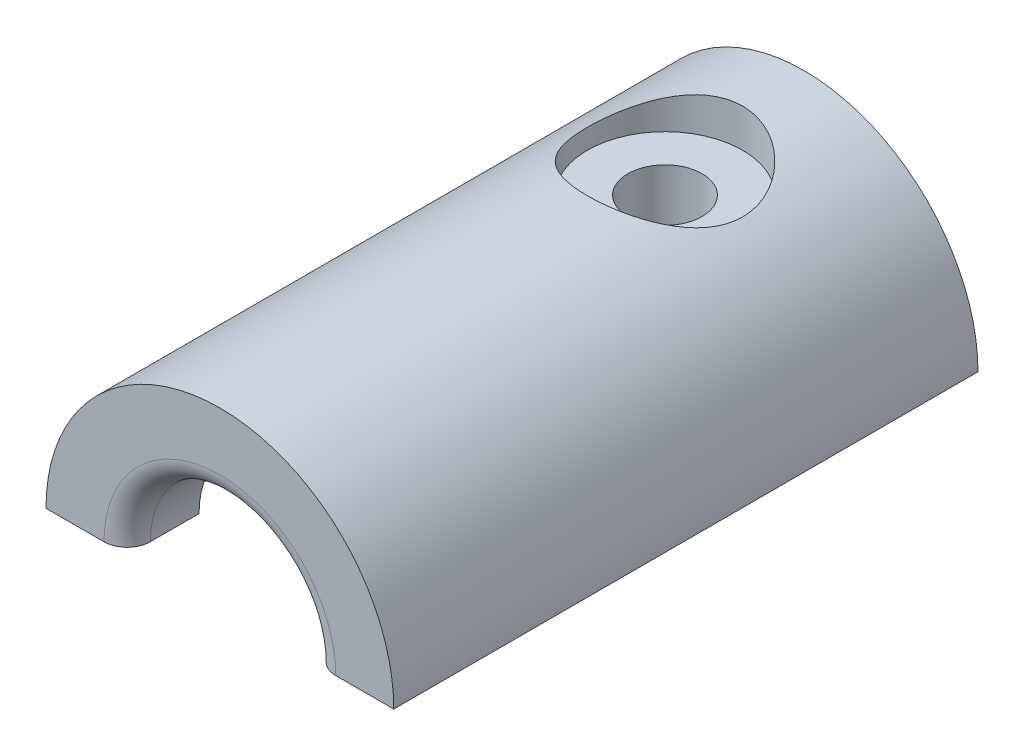
ISO-10303-21;
HEADER;
FILE_DESCRIPTION(('STEP AP214'),'2;1');
FILE_NAME('part.step','',(''),(''),'','','');
FILE_SCHEMA(('AUTOMOTIVE_DESIGN { 1 0 10303 214 1 1 1 1 }'));
ENDSEC;
DATA;
#1=APPLICATION_CONTEXT('core data for automotive mechanical design processes');
#2=APPLICATION_PROTOCOL_DEFINITION('international standard','automotive_design',2000,#1);
#3=PRODUCT_CONTEXT('',#1,'mechanical');
#4=PRODUCT('Part','Part','',(#3));
#5=PRODUCT_RELATED_PRODUCT_CATEGORY('part','',(#4));
#6=PRODUCT_DEFINITION_FORMATION('','',#4);
#7=PRODUCT_DEFINITION_CONTEXT('part definition',#1,'design');
#8=PRODUCT_DEFINITION('design','',#6,#7);
#9=PRODUCT_DEFINITION_SHAPE('','',#8);
#10=(LENGTH_UNIT() NAMED_UNIT(*) SI_UNIT(.MILLI.,.METRE.));
#11=(NAMED_UNIT(*) PLANE_ANGLE_UNIT() SI_UNIT($,.RADIAN.));
#12=(NAMED_UNIT(*) SI_UNIT($,.STERADIAN.) SOLID_ANGLE_UNIT());
#13=UNCERTAINTY_MEASURE_WITH_UNIT(LENGTH_MEASURE(1.E-05),#10,'distance_accuracy_value','');
#14=(GEOMETRIC_REPRESENTATION_CONTEXT(3) GLOBAL_UNCERTAINTY_ASSIGNED_CONTEXT((#13)) GLOBAL_UNIT_ASSIGNED_CONTEXT((#10,
#11,#12)) REPRESENTATION_CONTEXT('',''));
#15=CARTESIAN_POINT('',(0.,0.,0.));
#16=DIRECTION('',(0.,0.,1.));
#17=DIRECTION('',(1.,0.,0.));
#18=AXIS2_PLACEMENT_3D('',#15,#16,#17);
#19=CARTESIAN_POINT('',(0.,0.,10.5));
#20=DIRECTION('',(0.,0.,1.));
#21=DIRECTION('',(1.,0.,0.));
#22=AXIS2_PLACEMENT_3D('',#19,#20,#21);
#23=PLANE('',#22);
#24=DIRECTION('',(-1.,0.,0.));
#25=VECTOR('',#24,1.);
#26=CARTESIAN_POINT('',(0.,0.,10.5));
#27=LINE('',#26,#25);
#28=CARTESIAN_POINT('',(5.075,0.,10.5));
#29=VERTEX_POINT('',#28);
#30=CARTESIAN_POINT('',(4.,0.,10.5));
#31=VERTEX_POINT('',#30);
#32=EDGE_CURVE('E274',#29,#31,#27,.T.);
#33=ORIENTED_EDGE('',*,*,#32,.F.);
#34=CARTESIAN_POINT('',(0.,0.,10.5));
#35=DIRECTION('',(0.,0.,1.));
#36=DIRECTION('',(1.,0.,0.));
#37=AXIS2_PLACEMENT_3D('',#34,#35,#36);
#38=CIRCLE('',#37,5.075);
#39=CARTESIAN_POINT('',(-5.075,0.,10.5));
#40=VERTEX_POINT('',#39);
#41=EDGE_CURVE('E159',#29,#40,#38,.T.);
#42=ORIENTED_EDGE('',*,*,#41,.T.);
#43=CARTESIAN_POINT('',(-4.,0.,10.5));
#44=VERTEX_POINT('',#43);
#45=EDGE_CURVE('E271',#44,#40,#27,.T.);
#46=ORIENTED_EDGE('',*,*,#45,.F.);
#47=CARTESIAN_POINT('',(0.,0.,10.5));
#48=DIRECTION('',(0.,0.,1.));
#49=DIRECTION('',(1.,0.,0.));
#50=AXIS2_PLACEMENT_3D('',#47,#48,#49);
#51=CIRCLE('',#50,4.);
#52=EDGE_CURVE('E169',#31,#44,#51,.T.);
#53=ORIENTED_EDGE('',*,*,#52,.F.);
#54=EDGE_LOOP('',(#33,#42,#46,#53));
#55=FACE_BOUND('',#54,.T.);
#56=ADVANCED_FACE('F44',(#55),#23,.T.);
#57=CARTESIAN_POINT('',(0.,0.,7.5));
#58=DIRECTION('',(0.,0.,1.));
#59=DIRECTION('',(1.,0.,0.));
#60=AXIS2_PLACEMENT_3D('',#57,#58,#59);
#61=PLANE('',#60);
#62=DIRECTION('',(-1.,0.,0.));
#63=VECTOR('',#62,1.);
#64=CARTESIAN_POINT('',(0.,0.,7.5));
#65=LINE('',#64,#63);
#66=CARTESIAN_POINT('',(4.,0.,7.5));
#67=VERTEX_POINT('',#66);
#68=CARTESIAN_POINT('',(3.,0.,7.5));
#69=VERTEX_POINT('',#68);
#70=EDGE_CURVE('E279',#67,#69,#65,.T.);
#71=ORIENTED_EDGE('',*,*,#70,.F.);
#72=CARTESIAN_POINT('',(0.,0.,7.5));
#73=DIRECTION('',(0.,0.,1.));
#74=DIRECTION('',(1.,0.,0.));
#75=AXIS2_PLACEMENT_3D('',#72,#73,#74);
#76=CIRCLE('',#75,4.);
#77=CARTESIAN_POINT('',(-4.,0.,7.5));
#78=VERTEX_POINT('',#77);
#79=EDGE_CURVE('E168',#67,#78,#76,.T.);
#80=ORIENTED_EDGE('',*,*,#79,.T.);
#81=CARTESIAN_POINT('',(-3.,0.,7.5));
#82=VERTEX_POINT('',#81);
#83=EDGE_CURVE('E276',#82,#78,#65,.T.);
#84=ORIENTED_EDGE('',*,*,#83,.F.);
#85=CARTESIAN_POINT('',(0.,0.,7.5));
#86=DIRECTION('',(0.,0.,1.));
#87=DIRECTION('',(1.,0.,0.));
#88=AXIS2_PLACEMENT_3D('',#85,#86,#87);
#89=CIRCLE('',#88,3.);
#90=EDGE_CURVE('E174',#69,#82,#89,.T.);
#91=ORIENTED_EDGE('',*,*,#90,.F.);
#92=EDGE_LOOP('',(#71,#80,#84,#91));
#93=FACE_BOUND('',#92,.T.);
#94=ADVANCED_FACE('F224',(#93),#61,.T.);
#95=CARTESIAN_POINT('',(0.,0.,7.5));
#96=DIRECTION('',(0.,0.,-1.));
#97=DIRECTION('',(-1.,0.,0.));
#98=AXIS2_PLACEMENT_3D('',#95,#96,#97);
#99=CYLINDRICAL_SURFACE('',#98,3.);
#100=DIRECTION('',(0.,0.,-1.));
#101=VECTOR('',#100,1.);
#102=CARTESIAN_POINT('',(-3.,0.,7.5));
#103=LINE('',#102,#101);
#104=CARTESIAN_POINT('',(-3.,0.,-5.5));
#105=VERTEX_POINT('',#104);
#106=EDGE_CURVE('E278',#105,#82,#103,.F.);
#107=ORIENTED_EDGE('',*,*,#106,.F.);
#108=CARTESIAN_POINT('',(0.,0.,-5.5));
#109=DIRECTION('',(0.,0.,1.));
#110=DIRECTION('',(1.,0.,0.));
#111=AXIS2_PLACEMENT_3D('',#108,#109,#110);
#112=CIRCLE('',#111,3.);
#113=CARTESIAN_POINT('',(3.,0.,-5.5));
#114=VERTEX_POINT('',#113);
#115=EDGE_CURVE('E52',#105,#114,#112,.F.);
#116=ORIENTED_EDGE('',*,*,#115,.T.);
#117=DIRECTION('',(0.,0.,-1.));
#118=VECTOR('',#117,1.);
#119=CARTESIAN_POINT('',(3.,0.,7.5));
#120=LINE('',#119,#118);
#121=EDGE_CURVE('E285',#69,#114,#120,.T.);
#122=ORIENTED_EDGE('',*,*,#121,.F.);
#123=ORIENTED_EDGE('',*,*,#90,.T.);
#124=EDGE_LOOP('',(#107,#116,#122,#123));
#125=FACE_BOUND('',#124,.T.);
#126=CARTESIAN_POINT('',(0.,3.,0.0999999999999985));
#127=CARTESIAN_POINT('',(-0.0834280085828024,2.99999516830785,0.0999945834258236));
#128=CARTESIAN_POINT('',(-0.166934582506535,2.99648378720922,0.0934368071766237));
#129=CARTESIAN_POINT('',(-0.331436394670318,2.98278259335468,0.0675165982663954));
#130=CARTESIAN_POINT('',(-0.412427539682874,2.97258243738723,0.0481343339923473));
#131=CARTESIAN_POINT('',(-0.569277189891046,2.94656073601314,-0.00243967971600229));
#132=CARTESIAN_POINT('',(-0.645155024474135,2.93076195982554,-0.0335836283787828));
#133=CARTESIAN_POINT('',(-0.79047094845943,2.89495499745187,-0.106525103424968));
#134=CARTESIAN_POINT('',(-0.859909008635981,2.87494679216347,-0.148322678154541));
#135=CARTESIAN_POINT('',(-0.995534638915593,2.83095801330151,-0.24450312345995));
#136=CARTESIAN_POINT('',(-1.06120405491229,2.80680229614067,-0.299535207025925));
#137=CARTESIAN_POINT('',(-1.18286806133739,2.75774084341935,-0.419206291387087));
#138=CARTESIAN_POINT('',(-1.23885417984541,2.73283447325624,-0.483853613518118));
#139=CARTESIAN_POINT('',(-1.34470883896841,2.68244281334124,-0.627956116905107));
#140=CARTESIAN_POINT('',(-1.39355367383636,2.65711191284795,-0.708224097121125));
#141=CARTESIAN_POINT('',(-1.4768528324153,2.6117367722112,-0.877291362492924));
#142=CARTESIAN_POINT('',(-1.51131827632936,2.59168845125878,-0.966083989554308));
#143=CARTESIAN_POINT('',(-1.56248710339327,2.56114789725882,-1.14410853876906));
#144=CARTESIAN_POINT('',(-1.5801662348633,2.55013659138239,-1.2329659441932));
#145=CARTESIAN_POINT('',(-1.60018994479719,2.53762662306212,-1.41300774391914));
#146=CARTESIAN_POINT('',(-1.60255389391569,2.53611594428854,-1.50418905226538));
#147=CARTESIAN_POINT('',(-1.59259204330144,2.54237297611912,-1.67244373129593));
#148=CARTESIAN_POINT('',(-1.5822864459542,2.54886502713221,-1.74969689324516));
#149=CARTESIAN_POINT('',(-1.55082691014658,2.56812634563423,-1.9011492478833));
#150=CARTESIAN_POINT('',(-1.52966860751486,2.58089813829439,-1.97534719901126));
#151=CARTESIAN_POINT('',(-1.47678050478154,2.6115255571428,-2.12067605314732));
#152=CARTESIAN_POINT('',(-1.4448238898618,2.62948894800927,-2.19170060617008));
#153=CARTESIAN_POINT('',(-1.37143304593392,2.66850094165746,-2.32773905271474));
#154=CARTESIAN_POINT('',(-1.32999461708736,2.68955091010761,-2.39275026473803));
#155=CARTESIAN_POINT('',(-1.23173704487371,2.73609049880501,-2.52497172242656));
#156=CARTESIAN_POINT('',(-1.17355258231979,2.76177798986485,-2.59110147049342));
#157=CARTESIAN_POINT('',(-1.0469027467487,2.81223117246244,-2.71315071537989));
#158=CARTESIAN_POINT('',(-0.978431146098923,2.83699629420455,-2.76906398158625));
#159=CARTESIAN_POINT('',(-0.828044154062362,2.88460021999069,-2.87227542982841));
#160=CARTESIAN_POINT('',(-0.745570968821582,2.90723646176344,-2.91886221638782));
#161=CARTESIAN_POINT('',(-0.572453719472288,2.9462079060851,-2.9970957663538));
#162=CARTESIAN_POINT('',(-0.481817034499115,2.96254873003402,-3.02875586400623));
#163=CARTESIAN_POINT('',(-0.30366442791181,2.9858199122846,-3.07335522481456));
#164=CARTESIAN_POINT('',(-0.216600262764062,2.99346409984953,-3.08772140261997));
#165=CARTESIAN_POINT('',(-0.0409791950824067,3.00100442054404,-3.10189500640086));
#166=CARTESIAN_POINT('',(0.0475768145688012,3.00090503432182,-3.10171085160458));
#167=CARTESIAN_POINT('',(0.215091919521215,2.99334764517664,-3.08750014233865));
#168=CARTESIAN_POINT('',(0.294192898535464,2.98655794488573,-3.07473071850347));
#169=CARTESIAN_POINT('',(0.448939109663164,2.96724376655693,-3.03778511580416));
#170=CARTESIAN_POINT('',(0.524583981374493,2.95471869192973,-3.0136077502866));
#171=CARTESIAN_POINT('',(0.672500335044404,2.92465141623378,-2.95405011506354));
#172=CARTESIAN_POINT('',(0.744640666753738,2.9069918992478,-2.91840553016343));
#173=CARTESIAN_POINT('',(0.882124314821923,2.86826876163522,-2.83724969139679));
#174=CARTESIAN_POINT('',(0.947464964005449,2.84720381343929,-2.7917345872462));
#175=CARTESIAN_POINT('',(1.07697928921282,2.80095291390707,-2.68651039778454));
#176=CARTESIAN_POINT('',(1.1402697302165,2.77556745933858,-2.62580066534228));
#177=CARTESIAN_POINT('',(1.256219725483,2.72505417098626,-2.49477432816968));
#178=CARTESIAN_POINT('',(1.30886943094942,2.69992659611925,-2.42444892341591));
#179=CARTESIAN_POINT('',(1.40548153261782,2.65099028655931,-2.27034702764994));
#180=CARTESIAN_POINT('',(1.44862048937835,2.62738421458254,-2.18598372244117));
#181=CARTESIAN_POINT('',(1.51964969635314,2.58695870125936,-2.00957981982766));
#182=CARTESIAN_POINT('',(1.54756166073896,2.57012960475316,-1.9175503717565));
#183=CARTESIAN_POINT('',(1.5845909036139,2.54745026922036,-1.73797230580491));
#184=CARTESIAN_POINT('',(1.59528122309048,2.54068617365327,-1.65086763256909));
#185=CARTESIAN_POINT('',(1.60220766902338,2.53632719775287,-1.47587937163927));
#186=CARTESIAN_POINT('',(1.59845364948011,2.53872606639137,-1.38799635575484));
#187=CARTESIAN_POINT('',(1.57811270148832,2.55140495355656,-1.22530729028392));
#188=CARTESIAN_POINT('',(1.56314118274069,2.5606915110498,-1.15021021854508));
#189=CARTESIAN_POINT('',(1.52298687295876,2.58477383442181,-1.00373208491777));
#190=CARTESIAN_POINT('',(1.49780029499239,2.59957164326813,-0.93235241223123));
#191=CARTESIAN_POINT('',(1.43616070422438,2.63415331148715,-0.790190440907262));
#192=CARTESIAN_POINT('',(1.3990864148575,2.65419696823125,-0.719742865169907));
#193=CARTESIAN_POINT('',(1.31534245335433,2.6966792141344,-0.585596128479051));
#194=CARTESIAN_POINT('',(1.26866761463333,2.71911908969113,-0.521900629275876));
#195=CARTESIAN_POINT('',(1.15916720525938,2.76774539611286,-0.393453812245603));
#196=CARTESIAN_POINT('',(1.09498203667427,2.79400424140764,-0.329882519126992));
#197=CARTESIAN_POINT('',(0.956300329149745,2.8444566012759,-0.214055459199152));
#198=CARTESIAN_POINT('',(0.881797165766555,2.86864877272258,-0.161807017699894));
#199=CARTESIAN_POINT('',(0.72204400515354,2.91302030182076,-0.069132080235816));
#200=CARTESIAN_POINT('',(0.636577331123638,2.93308821046928,-0.0290227475325287));
#201=CARTESIAN_POINT('',(0.458798662878496,2.96607713011319,0.0357072451099689));
#202=CARTESIAN_POINT('',(0.36650569376879,2.97901721406285,0.0603692641835009));
#203=CARTESIAN_POINT('',(0.227615355842192,2.99169552229494,0.0843853425759249));
#204=CARTESIAN_POINT('',(0.182355494246517,2.9947988863485,0.0902297684119494));
#205=CARTESIAN_POINT('',(0.091404954885603,2.9989524612278,0.0980386043083724));
#206=CARTESIAN_POINT('',(0.0457142719789322,3.00000264751962,0.10000296800498));
#207=CARTESIAN_POINT('',(0.,3.,0.0999999999999985));
#208=B_SPLINE_CURVE_WITH_KNOTS('',3,(#126,#127,#128,#129,#130,#131,#132,#133,#134,#135,#136,
#137,#138,#139,#140,#141,#142,#143,#144,#145,#146,#147,#148,#149,#150,#151,#152,#153,#154,#155,
#156,#157,#158,#159,#160,#161,#162,#163,#164,#165,#166,#167,#168,#169,#170,#171,#172,#173,#174,
#175,#176,#177,#178,#179,#180,#181,#182,#183,#184,#185,#186,#187,#188,#189,#190,#191,#192,#193,
#194,#195,#196,#197,#198,#199,#200,#201,#202,#203,#204,#205,#206,#207),.UNSPECIFIED.,.T.,.F.,(4,
2,2,2,2,2,2,2,2,2,2,2,2,2,2,2,2,2,2,2,2,2,2,2,2,2,2,2,2,2,2,2,2,2,2,2,2,2,2,2,4),(0.,
0.250099571937983,0.500586801159414,0.750066790862756,0.999547912726739,1.26551787503545,
1.53171937023862,1.82220042181315,2.11245641359362,2.38456600858369,2.65633137184324,
2.88985639109233,3.12347539088301,3.36234274397109,3.60131610556614,3.87540340557936,
4.14965730631695,4.44024459698543,4.7305718072894,4.99480330643343,5.2588819149833,
5.49900649956852,5.73915606740714,5.98529384057671,6.23152780022619,6.50427545175261,
6.77727440700571,7.06865169074468,7.35961236784539,7.62207574902765,7.8843601081339,
8.11476177641519,8.34524893751088,8.59058452776184,8.83605249367795,9.11702751803744,
9.3981837798729,9.68615329689656,9.97334846176489,10.110388568954,10.2474303136582),.UNSPECIFIED.);
#209=CARTESIAN_POINT('',(0.,3.,0.0999999999999985));
#210=VERTEX_POINT('',#209);
#211=EDGE_CURVE('E162',#210,#210,#208,.T.);
#212=ORIENTED_EDGE('',*,*,#211,.F.);
#213=EDGE_LOOP('',(#212));
#214=FACE_BOUND('',#213,.T.);
#215=ADVANCED_FACE('F193',(#125,#214),#99,.F.);
#216=CARTESIAN_POINT('',(0.,0.,7.5));
#217=DIRECTION('',(0.,0.,-1.));
#218=DIRECTION('',(-1.,0.,0.));
#219=AXIS2_PLACEMENT_3D('',#216,#217,#218);
#220=CYLINDRICAL_SURFACE('',#219,7.5);
#221=CARTESIAN_POINT('',(0.,7.5,1.85));
#222=CARTESIAN_POINT('',(-0.0891878230733522,7.49999912717261,1.84999885503585));
#223=CARTESIAN_POINT('',(-0.178401619690432,7.49840328474661,1.84643118553665));
#224=CARTESIAN_POINT('',(-0.356163969702491,7.49206834436336,1.83220936869034));
#225=CARTESIAN_POINT('',(-0.444712117774008,7.48732746695073,1.82155120954673));
#226=CARTESIAN_POINT('',(-0.708674647806668,7.46851951941904,1.77902334732359));
#227=CARTESIAN_POINT('',(-0.882198739312517,7.44986751761951,1.73660055745727));
#228=CARTESIAN_POINT('',(-1.21830845258325,7.40233329988101,1.625621491257));
#229=CARTESIAN_POINT('',(-1.380930826572,7.37348775104977,1.55715881624625));
#230=CARTESIAN_POINT('',(-1.69223885151417,7.30832508429754,1.39646429333172));
#231=CARTESIAN_POINT('',(-1.84092758523209,7.27200962477349,1.30423772011118));
#232=CARTESIAN_POINT('',(-2.12868009271889,7.1931994009275,1.09319633940562));
#233=CARTESIAN_POINT('',(-2.26686162597413,7.15048348827961,0.97326221261356));
#234=CARTESIAN_POINT('',(-2.52192139812771,7.06456337005768,0.712626946106595));
#235=CARTESIAN_POINT('',(-2.63878681123637,7.02135888700638,0.571913395058772));
#236=CARTESIAN_POINT('',(-2.85473473918864,6.93648005152526,0.263621161077236));
#237=CARTESIAN_POINT('',(-2.95237827929314,6.89504280297632,0.0949528442853051));
#238=CARTESIAN_POINT('',(-3.07618717042241,6.84025629481261,-0.169920319053192));
#239=CARTESIAN_POINT('',(-3.11369038550638,6.82321742608652,-0.260225345375181));
#240=CARTESIAN_POINT('',(-3.1807853811548,6.79219938073378,-0.444219200727892));
#241=CARTESIAN_POINT('',(-3.21038142251154,6.77821855701441,-0.537906176369654));
#242=CARTESIAN_POINT('',(-3.25997092181759,6.754502626582,-0.722965669301146));
#243=CARTESIAN_POINT('',(-3.2803867469492,6.74458323749404,-0.814201695923129));
#244=CARTESIAN_POINT('',(-3.31354455557216,6.72835519410406,-0.998334628482308));
#245=CARTESIAN_POINT('',(-3.32629024871183,6.72204479439295,-1.09123070911471));
#246=CARTESIAN_POINT('',(-3.34394429802972,6.71328069807371,-1.27791978737817));
#247=CARTESIAN_POINT('',(-3.34885545443921,6.71082562349468,-1.37171245248719));
#248=CARTESIAN_POINT('',(-3.3507900876502,6.70985802583827,-1.55937014430342));
#249=CARTESIAN_POINT('',(-3.34781407932856,6.71134524540655,-1.65323516588729));
#250=CARTESIAN_POINT('',(-3.32833216588142,6.72104790031709,-1.9167427983518));
#251=CARTESIAN_POINT('',(-3.30275991249415,6.73376702753982,-2.08565189705706));
#252=CARTESIAN_POINT('',(-3.22670839757228,6.77053019821457,-2.4163612924311));
#253=CARTESIAN_POINT('',(-3.17622346470564,6.79457682029626,-2.57815996128367));
#254=CARTESIAN_POINT('',(-3.0507911103768,6.85182530028182,-2.89455181996008));
#255=CARTESIAN_POINT('',(-2.97531834980044,6.88522115605906,-3.04890065522463));
#256=CARTESIAN_POINT('',(-2.80242821411735,6.95738136763024,-3.34339129462046));
#257=CARTESIAN_POINT('',(-2.70500155934726,6.99614799091019,-3.4835270546171));
#258=CARTESIAN_POINT('',(-2.47973061889216,7.07931556142899,-3.76015415294416));
#259=CARTESIAN_POINT('',(-2.34983548709551,7.12389537195385,-3.89492697480307));
#260=CARTESIAN_POINT('',(-2.06891983186436,7.21048991066163,-4.14140119525038));
#261=CARTESIAN_POINT('',(-1.91789281917564,7.25250384519153,-4.25309548060483));
#262=CARTESIAN_POINT('',(-1.59310980978697,7.33080450784286,-4.45329487297038));
#263=CARTESIAN_POINT('',(-1.41880637415762,7.36688070419938,-4.54100050768136));
#264=CARTESIAN_POINT('',(-1.05589356321835,7.42757299791375,-4.68522309058996));
#265=CARTESIAN_POINT('',(-0.867293385301565,7.45219639154444,-4.74175989987477));
#266=CARTESIAN_POINT('',(-0.49541423458716,7.48578242804196,-4.81821104641536));
#267=CARTESIAN_POINT('',(-0.312697029728641,7.49572649594334,-4.84042562305749));
#268=CARTESIAN_POINT('',(0.0541143470097829,7.50204450595434,-4.85458259324785));
#269=CARTESIAN_POINT('',(0.238208023107876,7.49842311937112,-4.84653540752596));
#270=CARTESIAN_POINT('',(0.591106014494795,7.47863753129107,-4.80194940423143));
#271=CARTESIAN_POINT('',(0.760172761145971,7.46322355191668,-4.76711413466462));
#272=CARTESIAN_POINT('',(1.0898243614586,7.4222563077697,-4.67241307232124));
#273=CARTESIAN_POINT('',(1.25040818530438,7.39670181514277,-4.61254424833351));
#274=CARTESIAN_POINT('',(1.56422442090259,7.33686084189393,-4.46757681729823));
#275=CARTESIAN_POINT('',(1.71707166904953,7.30232701239935,-4.38174996232009));
#276=CARTESIAN_POINT('',(2.00674530156826,7.22809580323688,-4.18809628282505));
#277=CARTESIAN_POINT('',(2.14356465415082,7.1883961732213,-4.08025985869943));
#278=CARTESIAN_POINT('',(2.40903237079457,7.10404865147833,-3.83543526611232));
#279=CARTESIAN_POINT('',(2.5361114004775,7.05926090299216,-3.69678955909175));
#280=CARTESIAN_POINT('',(2.76573382727972,6.97250439020488,-3.399603633645));
#281=CARTESIAN_POINT('',(2.86826824448104,6.93053666166618,-3.24105616618016));
#282=CARTESIAN_POINT('',(3.048029107461,6.85341897165205,-2.90337469374242));
#283=CARTESIAN_POINT('',(3.124579475911,6.81845962370621,-2.72383382360263));
#284=CARTESIAN_POINT('',(3.24562568107346,6.76169082075318,-2.35233727249944));
#285=CARTESIAN_POINT('',(3.2901532977653,6.73986833199577,-2.16039410661238));
#286=CARTESIAN_POINT('',(3.34252277373077,6.71403874152609,-1.78717523166282));
#287=CARTESIAN_POINT('',(3.35317104785246,6.70867023355183,-1.60638702455598));
#288=CARTESIAN_POINT('',(3.34519481029594,6.71265216132077,-1.2456439261344));
#289=CARTESIAN_POINT('',(3.32657671161061,6.72199937248323,-1.06568886092309));
#290=CARTESIAN_POINT('',(3.26306098324107,6.75304004205783,-0.723199635893735));
#291=CARTESIAN_POINT('',(3.21984593482924,6.77394075563669,-0.560274064363178));
#292=CARTESIAN_POINT('',(3.11014911101142,6.82499900866567,-0.244011307139416));
#293=CARTESIAN_POINT('',(3.04366059198444,6.85515923079959,-0.0906769157403797));
#294=CARTESIAN_POINT('',(2.88441559448279,6.92373545957332,0.212860142203525));
#295=CARTESIAN_POINT('',(2.79024425832931,6.9625577948647,0.362226545176833));
#296=CARTESIAN_POINT('',(2.58012530772816,7.0431242917042,0.643910089808051));
#297=CARTESIAN_POINT('',(2.46416848263865,7.08486968438562,0.77621998013646));
#298=CARTESIAN_POINT('',(2.20164486607259,7.17101760321031,1.03215079861116));
#299=CARTESIAN_POINT('',(2.05327510819071,7.21532729460276,1.15395948267729));
#300=CARTESIAN_POINT('',(1.73654893060159,7.29801944853298,1.37118609811088));
#301=CARTESIAN_POINT('',(1.5681834083235,7.33639919317735,1.46659194392762));
#302=CARTESIAN_POINT('',(1.30505969454321,7.3861183968435,1.58683223249832));
#303=CARTESIAN_POINT('',(1.2160447547938,7.40132813537017,1.62298036196889));
#304=CARTESIAN_POINT('',(1.03484998023478,7.4288260416877,1.68760383509938));
#305=CARTESIAN_POINT('',(0.942671694899493,7.44111561710601,1.71608287643178));
#306=CARTESIAN_POINT('',(0.756075653319984,7.46238254483676,1.76498628481375));
#307=CARTESIAN_POINT('',(0.661663811011738,7.47136778571371,1.78542984342252));
#308=CARTESIAN_POINT('',(0.47120758644284,7.48579111608255,1.81809969845236));
#309=CARTESIAN_POINT('',(0.375164380395096,7.49123165847608,1.83033167739617));
#310=CARTESIAN_POINT('',(0.232402473803539,7.49654215287543,1.84225278484167));
#311=CARTESIAN_POINT('',(0.185981765942085,7.49783772853209,1.84515674831));
#312=CARTESIAN_POINT('',(0.0930430621754559,7.49956688511099,1.84903066655245));
#313=CARTESIAN_POINT('',(0.0465250650675257,7.50000045531273,1.8500005972736));
#314=CARTESIAN_POINT('',(0.,7.5,1.85));
#315=B_SPLINE_CURVE_WITH_KNOTS('',3,(#221,#222,#223,#224,#225,#226,#227,#228,#229,#230,#231,
#232,#233,#234,#235,#236,#237,#238,#239,#240,#241,#242,#243,#244,#245,#246,#247,#248,#249,#250,
#251,#252,#253,#254,#255,#256,#257,#258,#259,#260,#261,#262,#263,#264,#265,#266,#267,#268,#269,
#270,#271,#272,#273,#274,#275,#276,#277,#278,#279,#280,#281,#282,#283,#284,#285,#286,#287,#288,
#289,#290,#291,#292,#293,#294,#295,#296,#297,#298,#299,#300,#301,#302,#303,#304,#305,#306,#307,
#308,#309,#310,#311,#312,#313,#314),.UNSPECIFIED.,.T.,.F.,(4,2,2,2,2,2,2,2,2,2,2,2,2,2,2,2,2,2,
2,2,2,2,2,2,2,2,2,2,2,2,2,2,2,2,2,2,2,2,2,2,2,2,2,2,2,2,4),(0.,0.26751326393724,
0.53517801565926,1.07112426641232,1.6051619714855,2.13908124241904,2.70032995980735,
3.26191527134274,3.85633069213821,4.15375803401191,4.45102478199005,4.7326939199538,
5.01422671932786,5.29565887028437,5.57707264970395,6.08836497340047,6.59977374571786,
7.12270053434698,7.64584877423331,8.22052558835916,8.79537926520863,9.3875414547839,
9.97932587527004,10.5294027709321,11.0792902632907,11.5968365744592,12.1144455713584,
12.6481884955896,13.1821647144662,13.7595654782797,14.3371771687828,14.928835273785,
15.5199053928604,16.060534742559,16.601045643384,17.1083913405832,17.615884165951,
18.1560295211853,18.6964037593716,19.2847185999813,19.8733022901975,20.1647883673263,
20.4561336509594,20.7467788088226,21.0372226284548,21.1767698984418,21.3163189039251),.UNSPECIFIED.);
#316=CARTESIAN_POINT('',(0.,7.5,1.85));
#317=VERTEX_POINT('',#316);
#318=EDGE_CURVE('E177',#317,#317,#315,.T.);
#319=ORIENTED_EDGE('',*,*,#318,.T.);
#320=EDGE_LOOP('',(#319));
#321=FACE_BOUND('',#320,.T.);
#322=CARTESIAN_POINT('',(0.,0.,17.7));
#323=DIRECTION('',(0.,0.,1.));
#324=DIRECTION('',(1.,0.,0.));
#325=AXIS2_PLACEMENT_3D('',#322,#323,#324);
#326=CIRCLE('',#325,7.5);
#327=CARTESIAN_POINT('',(7.5,0.,17.7));
#328=VERTEX_POINT('',#327);
#329=CARTESIAN_POINT('',(-7.5,0.,17.7));
#330=VERTEX_POINT('',#329);
#331=EDGE_CURVE('E148',#328,#330,#326,.T.);
#332=ORIENTED_EDGE('',*,*,#331,.F.);
#333=DIRECTION('',(0.,0.,-1.));
#334=VECTOR('',#333,1.);
#335=CARTESIAN_POINT('',(7.5,0.,-7.5));
#336=LINE('',#335,#334);
#337=CARTESIAN_POINT('',(7.5,0.,-7.5));
#338=VERTEX_POINT('',#337);
#339=EDGE_CURVE('E141',#328,#338,#336,.T.);
#340=ORIENTED_EDGE('',*,*,#339,.T.);
#341=CARTESIAN_POINT('',(0.,0.,-7.5));
#342=DIRECTION('',(0.,0.,1.));
#343=DIRECTION('',(1.,0.,0.));
#344=AXIS2_PLACEMENT_3D('',#341,#342,#343);
#345=CIRCLE('',#344,7.5);
#346=CARTESIAN_POINT('',(-7.5,0.,-7.5));
#347=VERTEX_POINT('',#346);
#348=EDGE_CURVE('E150',#338,#347,#345,.T.);
#349=ORIENTED_EDGE('',*,*,#348,.T.);
#350=DIRECTION('',(0.,0.,1.));
#351=VECTOR('',#350,1.);
#352=CARTESIAN_POINT('',(-7.5,0.,-7.5));
#353=LINE('',#352,#351);
#354=EDGE_CURVE('E134',#347,#330,#353,.T.);
#355=ORIENTED_EDGE('',*,*,#354,.T.);
#356=EDGE_LOOP('',(#332,#340,#349,#355));
#357=FACE_BOUND('',#356,.T.);
#358=ADVANCED_FACE('F146',(#321,#357),#220,.T.);
#359=CARTESIAN_POINT('',(0.,0.,-7.5));
#360=DIRECTION('',(0.,0.,1.));
#361=DIRECTION('',(1.,0.,0.));
#362=AXIS2_PLACEMENT_3D('',#359,#360,#361);
#363=PLANE('',#362);
#364=DIRECTION('',(-1.,0.,0.));
#365=VECTOR('',#364,1.);
#366=CARTESIAN_POINT('',(-7.5,0.,-7.5));
#367=LINE('',#366,#365);
#368=CARTESIAN_POINT('',(5.,0.,-7.5));
#369=VERTEX_POINT('',#368);
#370=EDGE_CURVE('E259',#338,#369,#367,.T.);
#371=ORIENTED_EDGE('',*,*,#370,.T.);
#372=CARTESIAN_POINT('',(0.,0.,-7.5));
#373=DIRECTION('',(0.,0.,1.));
#374=DIRECTION('',(1.,0.,0.));
#375=AXIS2_PLACEMENT_3D('',#372,#373,#374);
#376=CIRCLE('',#375,5.);
#377=CARTESIAN_POINT('',(-5.,0.,-7.5));
#378=VERTEX_POINT('',#377);
#379=EDGE_CURVE('E253',#369,#378,#376,.T.);
#380=ORIENTED_EDGE('',*,*,#379,.T.);
#381=EDGE_CURVE('E258',#378,#347,#367,.T.);
#382=ORIENTED_EDGE('',*,*,#381,.T.);
#383=ORIENTED_EDGE('',*,*,#348,.F.);
#384=EDGE_LOOP('',(#371,#380,#382,#383));
#385=FACE_BOUND('',#384,.T.);
#386=ADVANCED_FACE('F220',(#385),#363,.F.);
#387=CARTESIAN_POINT('',(0.,0.,10.5));
#388=DIRECTION('',(0.,0.,-1.));
#389=DIRECTION('',(-1.,0.,0.));
#390=AXIS2_PLACEMENT_3D('',#387,#388,#389);
#391=CYLINDRICAL_SURFACE('',#390,4.);
#392=DIRECTION('',(0.,0.,-1.));
#393=VECTOR('',#392,1.);
#394=CARTESIAN_POINT('',(4.,0.,10.5));
#395=LINE('',#394,#393);
#396=EDGE_CURVE('E283',#31,#67,#395,.T.);
#397=ORIENTED_EDGE('',*,*,#396,.F.);
#398=ORIENTED_EDGE('',*,*,#52,.T.);
#399=DIRECTION('',(0.,0.,-1.));
#400=VECTOR('',#399,1.);
#401=CARTESIAN_POINT('',(-4.,0.,10.5));
#402=LINE('',#401,#400);
#403=EDGE_CURVE('E273',#78,#44,#402,.F.);
#404=ORIENTED_EDGE('',*,*,#403,.F.);
#405=ORIENTED_EDGE('',*,*,#79,.F.);
#406=EDGE_LOOP('',(#397,#398,#404,#405));
#407=FACE_BOUND('',#406,.T.);
#408=ADVANCED_FACE('F216',(#407),#391,.F.);
#409=CARTESIAN_POINT('',(0.,0.,14.6));
#410=DIRECTION('',(0.,0.,-1.));
#411=DIRECTION('',(-1.,0.,0.));
#412=AXIS2_PLACEMENT_3D('',#409,#410,#411);
#413=CYLINDRICAL_SURFACE('',#412,5.075);
#414=DIRECTION('',(0.,0.,-1.));
#415=VECTOR('',#414,1.);
#416=CARTESIAN_POINT('',(5.075,0.,14.6));
#417=LINE('',#416,#415);
#418=CARTESIAN_POINT('',(5.075,0.,14.6));
#419=VERTEX_POINT('',#418);
#420=EDGE_CURVE('E281',#419,#29,#417,.T.);
#421=ORIENTED_EDGE('',*,*,#420,.F.);
#422=CARTESIAN_POINT('',(0.,0.,14.6));
#423=DIRECTION('',(0.,0.,1.));
#424=DIRECTION('',(1.,0.,0.));
#425=AXIS2_PLACEMENT_3D('',#422,#423,#424);
#426=CIRCLE('',#425,5.075);
#427=CARTESIAN_POINT('',(-5.075,0.,14.6));
#428=VERTEX_POINT('',#427);
#429=EDGE_CURVE('E155',#419,#428,#426,.T.);
#430=ORIENTED_EDGE('',*,*,#429,.T.);
#431=DIRECTION('',(0.,0.,-1.));
#432=VECTOR('',#431,1.);
#433=CARTESIAN_POINT('',(-5.075,0.,14.6));
#434=LINE('',#433,#432);
#435=EDGE_CURVE('E268',#40,#428,#434,.F.);
#436=ORIENTED_EDGE('',*,*,#435,.F.);
#437=ORIENTED_EDGE('',*,*,#41,.F.);
#438=EDGE_LOOP('',(#421,#430,#436,#437));
#439=FACE_BOUND('',#438,.T.);
#440=ADVANCED_FACE('F212',(#439),#413,.F.);
#441=CARTESIAN_POINT('',(0.,0.,14.6));
#442=DIRECTION('',(0.,0.,1.));
#443=DIRECTION('',(1.,0.,0.));
#444=AXIS2_PLACEMENT_3D('',#441,#442,#443);
#445=PLANE('',#444);
#446=ORIENTED_EDGE('',*,*,#429,.F.);
#447=DIRECTION('',(-1.,0.,0.));
#448=VECTOR('',#447,1.);
#449=CARTESIAN_POINT('',(0.,0.,14.6));
#450=LINE('',#449,#448);
#451=CARTESIAN_POINT('',(4.,0.,14.6));
#452=VERTEX_POINT('',#451);
#453=EDGE_CURVE('E269',#419,#452,#450,.T.);
#454=ORIENTED_EDGE('',*,*,#453,.T.);
#455=CARTESIAN_POINT('',(0.,0.,14.6));
#456=DIRECTION('',(0.,0.,1.));
#457=DIRECTION('',(1.,0.,0.));
#458=AXIS2_PLACEMENT_3D('',#455,#456,#457);
#459=CIRCLE('',#458,4.);
#460=CARTESIAN_POINT('',(-4.,0.,14.6));
#461=VERTEX_POINT('',#460);
#462=EDGE_CURVE('E156',#452,#461,#459,.T.);
#463=ORIENTED_EDGE('',*,*,#462,.T.);
#464=EDGE_CURVE('E263',#461,#428,#450,.T.);
#465=ORIENTED_EDGE('',*,*,#464,.T.);
#466=EDGE_LOOP('',(#446,#454,#463,#465));
#467=FACE_BOUND('',#466,.T.);
#468=ADVANCED_FACE('F209',(#467),#445,.F.);
#469=CARTESIAN_POINT('',(0.,0.,17.7));
#470=DIRECTION('',(0.,0.,1.));
#471=DIRECTION('',(1.,0.,0.));
#472=AXIS2_PLACEMENT_3D('',#469,#470,#471);
#473=PLANE('',#472);
#474=DIRECTION('',(1.,0.,0.));
#475=VECTOR('',#474,1.);
#476=CARTESIAN_POINT('',(-7.5,0.,17.7));
#477=LINE('',#476,#475);
#478=CARTESIAN_POINT('',(-5.,0.,17.7));
#479=VERTEX_POINT('',#478);
#480=EDGE_CURVE('E131',#330,#479,#477,.T.);
#481=ORIENTED_EDGE('',*,*,#480,.T.);
#482=CARTESIAN_POINT('',(0.,0.,17.7));
#483=DIRECTION('',(0.,0.,1.));
#484=DIRECTION('',(1.,0.,0.));
#485=AXIS2_PLACEMENT_3D('',#482,#483,#484);
#486=CIRCLE('',#485,5.);
#487=CARTESIAN_POINT('',(5.,0.,17.7));
#488=VERTEX_POINT('',#487);
#489=EDGE_CURVE('E249',#479,#488,#486,.F.);
#490=ORIENTED_EDGE('',*,*,#489,.T.);
#491=EDGE_CURVE('E142',#488,#328,#477,.T.);
#492=ORIENTED_EDGE('',*,*,#491,.T.);
#493=ORIENTED_EDGE('',*,*,#331,.T.);
#494=EDGE_LOOP('',(#481,#490,#492,#493));
#495=FACE_BOUND('',#494,.T.);
#496=ADVANCED_FACE('F152',(#495),#473,.T.);
#497=CARTESIAN_POINT('',(0.,0.,17.7));
#498=DIRECTION('',(0.,0.,-1.));
#499=DIRECTION('',(-1.,0.,0.));
#500=AXIS2_PLACEMENT_3D('',#497,#498,#499);
#501=CYLINDRICAL_SURFACE('',#500,4.);
#502=DIRECTION('',(0.,0.,-1.));
#503=VECTOR('',#502,1.);
#504=CARTESIAN_POINT('',(4.,0.,17.7));
#505=LINE('',#504,#503);
#506=CARTESIAN_POINT('',(4.,0.,16.7));
#507=VERTEX_POINT('',#506);
#508=EDGE_CURVE('E241',#507,#452,#505,.T.);
#509=ORIENTED_EDGE('',*,*,#508,.F.);
#510=CARTESIAN_POINT('',(0.,0.,16.7));
#511=DIRECTION('',(0.,0.,1.));
#512=DIRECTION('',(1.,0.,0.));
#513=AXIS2_PLACEMENT_3D('',#510,#511,#512);
#514=CIRCLE('',#513,4.);
#515=CARTESIAN_POINT('',(-4.,0.,16.7));
#516=VERTEX_POINT('',#515);
#517=EDGE_CURVE('E243',#507,#516,#514,.T.);
#518=ORIENTED_EDGE('',*,*,#517,.T.);
#519=DIRECTION('',(0.,0.,-1.));
#520=VECTOR('',#519,1.);
#521=CARTESIAN_POINT('',(-4.,0.,17.7));
#522=LINE('',#521,#520);
#523=EDGE_CURVE('E240',#461,#516,#522,.F.);
#524=ORIENTED_EDGE('',*,*,#523,.F.);
#525=ORIENTED_EDGE('',*,*,#462,.F.);
#526=EDGE_LOOP('',(#509,#518,#524,#525));
#527=FACE_BOUND('',#526,.T.);
#528=ADVANCED_FACE('F203',(#527),#501,.F.);
#529=CARTESIAN_POINT('',(0.,7.5,-1.5));
#530=DIRECTION('',(0.,1.,0.));
#531=DIRECTION('',(0.,0.,1.));
#532=AXIS2_PLACEMENT_3D('',#529,#530,#531);
#533=CYLINDRICAL_SURFACE('',#532,3.35);
#534=CARTESIAN_POINT('',(0.,5.85,-1.5));
#535=DIRECTION('',(0.,1.,0.));
#536=DIRECTION('',(0.,0.,1.));
#537=AXIS2_PLACEMENT_3D('',#534,#535,#536);
#538=CIRCLE('',#537,3.35);
#539=CARTESIAN_POINT('',(0.,5.85,1.85));
#540=VERTEX_POINT('',#539);
#541=EDGE_CURVE('E287',#540,#540,#538,.T.);
#542=ORIENTED_EDGE('',*,*,#541,.F.);
#543=EDGE_LOOP('',(#542));
#544=FACE_BOUND('',#543,.T.);
#545=ORIENTED_EDGE('',*,*,#318,.F.);
#546=EDGE_LOOP('',(#545));
#547=FACE_BOUND('',#546,.T.);
#548=ADVANCED_FACE('F201',(#544,#547),#533,.F.);
#549=CARTESIAN_POINT('',(0.,7.5,-1.5));
#550=DIRECTION('',(0.,1.,0.));
#551=DIRECTION('',(0.,0.,1.));
#552=AXIS2_PLACEMENT_3D('',#549,#550,#551);
#553=CYLINDRICAL_SURFACE('',#552,1.6);
#554=ORIENTED_EDGE('',*,*,#211,.T.);
#555=EDGE_LOOP('',(#554));
#556=FACE_BOUND('',#555,.T.);
#557=CARTESIAN_POINT('',(0.,5.85,-1.5));
#558=DIRECTION('',(0.,1.,0.));
#559=DIRECTION('',(0.,0.,1.));
#560=AXIS2_PLACEMENT_3D('',#557,#558,#559);
#561=CIRCLE('',#560,1.6);
#562=CARTESIAN_POINT('',(0.,5.85,0.0999999999999992));
#563=VERTEX_POINT('',#562);
#564=EDGE_CURVE('E186',#563,#563,#561,.T.);
#565=ORIENTED_EDGE('',*,*,#564,.T.);
#566=EDGE_LOOP('',(#565));
#567=FACE_BOUND('',#566,.T.);
#568=ADVANCED_FACE('F195',(#556,#567),#553,.F.);
#569=CARTESIAN_POINT('',(1.6,5.85,-1.5));
#570=DIRECTION('',(0.,-1.,0.));
#571=DIRECTION('',(0.,0.,-1.));
#572=AXIS2_PLACEMENT_3D('',#569,#570,#571);
#573=PLANE('',#572);
#574=ORIENTED_EDGE('',*,*,#564,.F.);
#575=EDGE_LOOP('',(#574));
#576=FACE_BOUND('',#575,.T.);
#577=ORIENTED_EDGE('',*,*,#541,.T.);
#578=EDGE_LOOP('',(#577));
#579=FACE_BOUND('',#578,.T.);
#580=ADVANCED_FACE('F200',(#576,#579),#573,.F.);
#581=CARTESIAN_POINT('',(0.,0.,0.));
#582=DIRECTION('',(0.,1.,0.));
#583=DIRECTION('',(0.,0.,1.));
#584=AXIS2_PLACEMENT_3D('',#581,#582,#583);
#585=PLANE('',#584);
#586=ORIENTED_EDGE('',*,*,#381,.F.);
#587=CARTESIAN_POINT('',(-5.,0.,-5.5));
#588=DIRECTION('',(0.,1.,0.));
#589=DIRECTION('',(0.,0.,1.));
#590=AXIS2_PLACEMENT_3D('',#587,#588,#589);
#591=CIRCLE('',#590,2.);
#592=EDGE_CURVE('E66',#378,#105,#591,.F.);
#593=ORIENTED_EDGE('',*,*,#592,.T.);
#594=ORIENTED_EDGE('',*,*,#106,.T.);
#595=ORIENTED_EDGE('',*,*,#83,.T.);
#596=ORIENTED_EDGE('',*,*,#403,.T.);
#597=ORIENTED_EDGE('',*,*,#45,.T.);
#598=ORIENTED_EDGE('',*,*,#435,.T.);
#599=ORIENTED_EDGE('',*,*,#464,.F.);
#600=ORIENTED_EDGE('',*,*,#523,.T.);
#601=CARTESIAN_POINT('',(-5.,0.,16.7));
#602=DIRECTION('',(0.,1.,0.));
#603=DIRECTION('',(0.,0.,1.));
#604=AXIS2_PLACEMENT_3D('',#601,#602,#603);
#605=CIRCLE('',#604,1.);
#606=EDGE_CURVE('E137',#516,#479,#605,.F.);
#607=ORIENTED_EDGE('',*,*,#606,.T.);
#608=ORIENTED_EDGE('',*,*,#480,.F.);
#609=ORIENTED_EDGE('',*,*,#354,.F.);
#610=EDGE_LOOP('',(#586,#593,#594,#595,#596,#597,#598,#599,#600,#607,#608,#609));
#611=FACE_BOUND('',#610,.T.);
#612=ADVANCED_FACE('F133',(#611),#585,.F.);
#613=ORIENTED_EDGE('',*,*,#121,.T.);
#614=CARTESIAN_POINT('',(5.,0.,-5.5));
#615=DIRECTION('',(0.,1.,0.));
#616=DIRECTION('',(0.,0.,1.));
#617=AXIS2_PLACEMENT_3D('',#614,#615,#616);
#618=CIRCLE('',#617,2.);
#619=EDGE_CURVE('E11',#114,#369,#618,.F.);
#620=ORIENTED_EDGE('',*,*,#619,.T.);
#621=ORIENTED_EDGE('',*,*,#370,.F.);
#622=ORIENTED_EDGE('',*,*,#339,.F.);
#623=ORIENTED_EDGE('',*,*,#491,.F.);
#624=CARTESIAN_POINT('',(5.,0.,16.7));
#625=DIRECTION('',(0.,1.,0.));
#626=DIRECTION('',(0.,0.,1.));
#627=AXIS2_PLACEMENT_3D('',#624,#625,#626);
#628=CIRCLE('',#627,1.);
#629=EDGE_CURVE('E251',#488,#507,#628,.F.);
#630=ORIENTED_EDGE('',*,*,#629,.T.);
#631=ORIENTED_EDGE('',*,*,#508,.T.);
#632=ORIENTED_EDGE('',*,*,#453,.F.);
#633=ORIENTED_EDGE('',*,*,#420,.T.);
#634=ORIENTED_EDGE('',*,*,#32,.T.);
#635=ORIENTED_EDGE('',*,*,#396,.T.);
#636=ORIENTED_EDGE('',*,*,#70,.T.);
#637=EDGE_LOOP('',(#613,#620,#621,#622,#623,#630,#631,#632,#633,#634,#635,#636));
#638=FACE_BOUND('',#637,.T.);
#639=ADVANCED_FACE('F303',(#638),#585,.F.);
#640=CARTESIAN_POINT('',(0.,0.,16.7));
#641=DIRECTION('',(0.,0.,1.));
#642=DIRECTION('',(1.,0.,0.));
#643=AXIS2_PLACEMENT_3D('',#640,#641,#642);
#644=TOROIDAL_SURFACE('',#643,5.,1.);
#645=ORIENTED_EDGE('',*,*,#629,.F.);
#646=ORIENTED_EDGE('',*,*,#489,.F.);
#647=ORIENTED_EDGE('',*,*,#606,.F.);
#648=ORIENTED_EDGE('',*,*,#517,.F.);
#649=EDGE_LOOP('',(#645,#646,#647,#648));
#650=FACE_BOUND('',#649,.T.);
#651=ADVANCED_FACE('F307',(#650),#644,.T.);
#652=CARTESIAN_POINT('',(0.,0.,-5.5));
#653=DIRECTION('',(0.,0.,1.));
#654=DIRECTION('',(1.,0.,0.));
#655=AXIS2_PLACEMENT_3D('',#652,#653,#654);
#656=TOROIDAL_SURFACE('',#655,5.,2.);
#657=ORIENTED_EDGE('',*,*,#619,.F.);
#658=ORIENTED_EDGE('',*,*,#115,.F.);
#659=ORIENTED_EDGE('',*,*,#592,.F.);
#660=ORIENTED_EDGE('',*,*,#379,.F.);
#661=EDGE_LOOP('',(#657,#658,#659,#660));
#662=FACE_BOUND('',#661,.T.);
#663=ADVANCED_FACE('F46',(#662),#656,.T.);
#664=CLOSED_SHELL('',(#56,#94,#215,#358,#386,#408,#440,#468,#496,#528,#548,#568,#580,#612,#639,
#651,#663));
#665=MANIFOLD_SOLID_BREP('B2',#664);
#666=ADVANCED_BREP_SHAPE_REPRESENTATION('',(#18,#665),#14);
#667=SHAPE_DEFINITION_REPRESENTATION(#9,#666);
ENDSEC;
END-ISO-10303-21;
